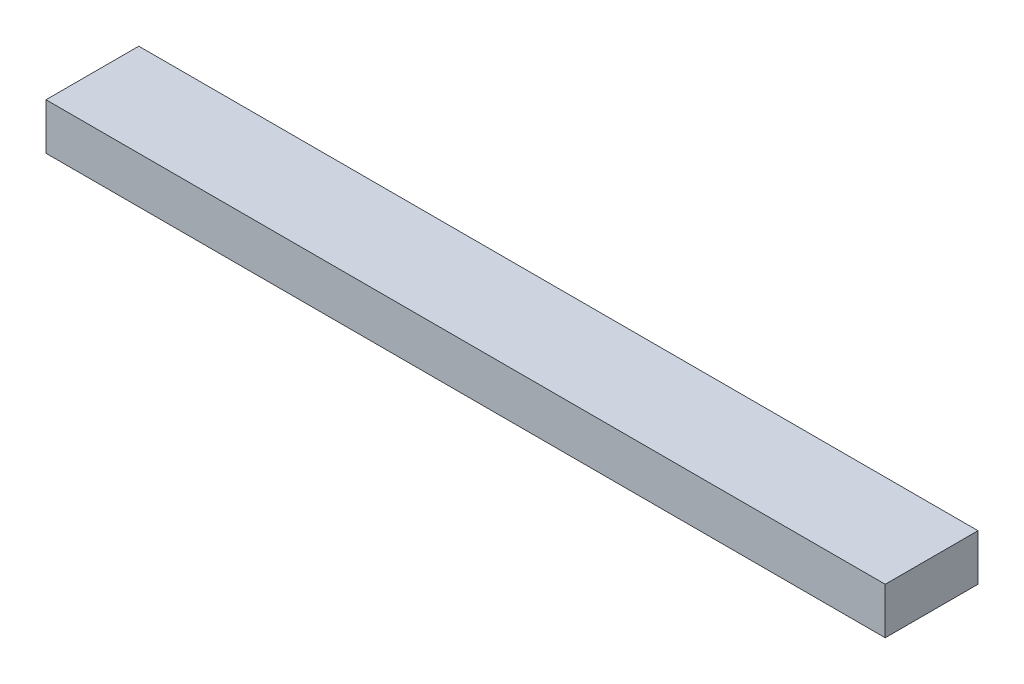
ISO-10303-21;
HEADER;
FILE_DESCRIPTION(('STEP AP214'),'2;1');
FILE_NAME('part.step','',(''),(''),'','','');
FILE_SCHEMA(('AUTOMOTIVE_DESIGN { 1 0 10303 214 1 1 1 1 }'));
ENDSEC;
DATA;
#1=APPLICATION_CONTEXT('core data for automotive mechanical design processes');
#2=APPLICATION_PROTOCOL_DEFINITION('international standard','automotive_design',2000,#1);
#3=PRODUCT_CONTEXT('',#1,'mechanical');
#4=PRODUCT('Part','Part','',(#3));
#5=PRODUCT_RELATED_PRODUCT_CATEGORY('part','',(#4));
#6=PRODUCT_DEFINITION_FORMATION('','',#4);
#7=PRODUCT_DEFINITION_CONTEXT('part definition',#1,'design');
#8=PRODUCT_DEFINITION('design','',#6,#7);
#9=PRODUCT_DEFINITION_SHAPE('','',#8);
#10=(LENGTH_UNIT() NAMED_UNIT(*) SI_UNIT(.MILLI.,.METRE.));
#11=(NAMED_UNIT(*) PLANE_ANGLE_UNIT() SI_UNIT($,.RADIAN.));
#12=(NAMED_UNIT(*) SI_UNIT($,.STERADIAN.) SOLID_ANGLE_UNIT());
#13=UNCERTAINTY_MEASURE_WITH_UNIT(LENGTH_MEASURE(1.E-05),#10,'distance_accuracy_value','');
#14=(GEOMETRIC_REPRESENTATION_CONTEXT(3) GLOBAL_UNCERTAINTY_ASSIGNED_CONTEXT((#13)) GLOBAL_UNIT_ASSIGNED_CONTEXT((#10,
#11,#12)) REPRESENTATION_CONTEXT('',''));
#15=CARTESIAN_POINT('',(0.,0.,0.));
#16=DIRECTION('',(0.,0.,1.));
#17=DIRECTION('',(1.,0.,0.));
#18=AXIS2_PLACEMENT_3D('',#15,#16,#17);
#19=CARTESIAN_POINT('',(-1809.,-50.,100.));
#20=DIRECTION('',(0.,0.,1.));
#21=DIRECTION('',(1.,0.,0.));
#22=AXIS2_PLACEMENT_3D('',#19,#20,#21);
#23=PLANE('',#22);
#24=DIRECTION('',(0.,-1.,0.));
#25=VECTOR('',#24,1.);
#26=CARTESIAN_POINT('',(0.,-50.,100.));
#27=LINE('',#26,#25);
#28=CARTESIAN_POINT('',(0.,50.,100.));
#29=VERTEX_POINT('',#28);
#30=CARTESIAN_POINT('',(0.,-50.,100.));
#31=VERTEX_POINT('',#30);
#32=EDGE_CURVE('E99',#29,#31,#27,.T.);
#33=ORIENTED_EDGE('',*,*,#32,.F.);
#34=DIRECTION('',(1.,0.,0.));
#35=VECTOR('',#34,1.);
#36=CARTESIAN_POINT('',(-1809.,50.,100.));
#37=LINE('',#36,#35);
#38=CARTESIAN_POINT('',(-1809.,50.,100.));
#39=VERTEX_POINT('',#38);
#40=EDGE_CURVE('E11',#39,#29,#37,.T.);
#41=ORIENTED_EDGE('',*,*,#40,.F.);
#42=DIRECTION('',(0.,-1.,0.));
#43=VECTOR('',#42,1.);
#44=CARTESIAN_POINT('',(-1809.,-50.,100.));
#45=LINE('',#44,#43);
#46=CARTESIAN_POINT('',(-1809.,-50.,100.));
#47=VERTEX_POINT('',#46);
#48=EDGE_CURVE('E93',#39,#47,#45,.T.);
#49=ORIENTED_EDGE('',*,*,#48,.T.);
#50=DIRECTION('',(1.,0.,0.));
#51=VECTOR('',#50,1.);
#52=CARTESIAN_POINT('',(-1809.,-50.,100.));
#53=LINE('',#52,#51);
#54=EDGE_CURVE('E38',#47,#31,#53,.T.);
#55=ORIENTED_EDGE('',*,*,#54,.T.);
#56=EDGE_LOOP('',(#33,#41,#49,#55));
#57=FACE_BOUND('',#56,.T.);
#58=ADVANCED_FACE('F35',(#57),#23,.T.);
#59=CARTESIAN_POINT('',(-1809.,50.,-100.));
#60=DIRECTION('',(0.,1.,0.));
#61=DIRECTION('',(0.,0.,1.));
#62=AXIS2_PLACEMENT_3D('',#59,#60,#61);
#63=PLANE('',#62);
#64=DIRECTION('',(0.,0.,1.));
#65=VECTOR('',#64,1.);
#66=CARTESIAN_POINT('',(0.,50.,-100.));
#67=LINE('',#66,#65);
#68=CARTESIAN_POINT('',(0.,50.,-100.));
#69=VERTEX_POINT('',#68);
#70=EDGE_CURVE('E95',#69,#29,#67,.T.);
#71=ORIENTED_EDGE('',*,*,#70,.F.);
#72=DIRECTION('',(1.,0.,0.));
#73=VECTOR('',#72,1.);
#74=CARTESIAN_POINT('',(-1809.,50.,-100.));
#75=LINE('',#74,#73);
#76=CARTESIAN_POINT('',(-1809.,50.,-100.));
#77=VERTEX_POINT('',#76);
#78=EDGE_CURVE('E44',#77,#69,#75,.T.);
#79=ORIENTED_EDGE('',*,*,#78,.F.);
#80=DIRECTION('',(0.,0.,1.));
#81=VECTOR('',#80,1.);
#82=CARTESIAN_POINT('',(-1809.,50.,-100.));
#83=LINE('',#82,#81);
#84=EDGE_CURVE('E90',#77,#39,#83,.T.);
#85=ORIENTED_EDGE('',*,*,#84,.T.);
#86=ORIENTED_EDGE('',*,*,#40,.T.);
#87=EDGE_LOOP('',(#71,#79,#85,#86));
#88=FACE_BOUND('',#87,.T.);
#89=ADVANCED_FACE('F109',(#88),#63,.T.);
#90=CARTESIAN_POINT('',(-1809.,-50.,-100.));
#91=DIRECTION('',(0.,0.,-1.));
#92=DIRECTION('',(-1.,0.,0.));
#93=AXIS2_PLACEMENT_3D('',#90,#91,#92);
#94=PLANE('',#93);
#95=DIRECTION('',(0.,1.,0.));
#96=VECTOR('',#95,1.);
#97=CARTESIAN_POINT('',(0.,-50.,-100.));
#98=LINE('',#97,#96);
#99=CARTESIAN_POINT('',(0.,-50.,-100.));
#100=VERTEX_POINT('',#99);
#101=EDGE_CURVE('E85',#100,#69,#98,.T.);
#102=ORIENTED_EDGE('',*,*,#101,.F.);
#103=DIRECTION('',(1.,0.,0.));
#104=VECTOR('',#103,1.);
#105=CARTESIAN_POINT('',(-1809.,-50.,-100.));
#106=LINE('',#105,#104);
#107=CARTESIAN_POINT('',(-1809.,-50.,-100.));
#108=VERTEX_POINT('',#107);
#109=EDGE_CURVE('E80',#108,#100,#106,.T.);
#110=ORIENTED_EDGE('',*,*,#109,.F.);
#111=DIRECTION('',(0.,1.,0.));
#112=VECTOR('',#111,1.);
#113=CARTESIAN_POINT('',(-1809.,-50.,-100.));
#114=LINE('',#113,#112);
#115=EDGE_CURVE('E83',#108,#77,#114,.T.);
#116=ORIENTED_EDGE('',*,*,#115,.T.);
#117=ORIENTED_EDGE('',*,*,#78,.T.);
#118=EDGE_LOOP('',(#102,#110,#116,#117));
#119=FACE_BOUND('',#118,.T.);
#120=ADVANCED_FACE('F82',(#119),#94,.T.);
#121=CARTESIAN_POINT('',(-1809.,-50.,-100.));
#122=DIRECTION('',(0.,-1.,0.));
#123=DIRECTION('',(0.,0.,-1.));
#124=AXIS2_PLACEMENT_3D('',#121,#122,#123);
#125=PLANE('',#124);
#126=DIRECTION('',(0.,0.,-1.));
#127=VECTOR('',#126,1.);
#128=CARTESIAN_POINT('',(0.,-50.,-100.));
#129=LINE('',#128,#127);
#130=EDGE_CURVE('E102',#31,#100,#129,.T.);
#131=ORIENTED_EDGE('',*,*,#130,.F.);
#132=ORIENTED_EDGE('',*,*,#54,.F.);
#133=DIRECTION('',(0.,0.,-1.));
#134=VECTOR('',#133,1.);
#135=CARTESIAN_POINT('',(-1809.,-50.,-100.));
#136=LINE('',#135,#134);
#137=EDGE_CURVE('E89',#47,#108,#136,.T.);
#138=ORIENTED_EDGE('',*,*,#137,.T.);
#139=ORIENTED_EDGE('',*,*,#109,.T.);
#140=EDGE_LOOP('',(#131,#132,#138,#139));
#141=FACE_BOUND('',#140,.T.);
#142=ADVANCED_FACE('F92',(#141),#125,.T.);
#143=CARTESIAN_POINT('',(-1809.,0.,0.));
#144=DIRECTION('',(1.,0.,0.));
#145=DIRECTION('',(0.,0.,-1.));
#146=AXIS2_PLACEMENT_3D('',#143,#144,#145);
#147=PLANE('',#146);
#148=ORIENTED_EDGE('',*,*,#48,.F.);
#149=ORIENTED_EDGE('',*,*,#84,.F.);
#150=ORIENTED_EDGE('',*,*,#115,.F.);
#151=ORIENTED_EDGE('',*,*,#137,.F.);
#152=EDGE_LOOP('',(#148,#149,#150,#151));
#153=FACE_BOUND('',#152,.T.);
#154=ADVANCED_FACE('F88',(#153),#147,.F.);
#155=CARTESIAN_POINT('',(0.,0.,0.));
#156=DIRECTION('',(1.,0.,0.));
#157=DIRECTION('',(0.,0.,-1.));
#158=AXIS2_PLACEMENT_3D('',#155,#156,#157);
#159=PLANE('',#158);
#160=ORIENTED_EDGE('',*,*,#32,.T.);
#161=ORIENTED_EDGE('',*,*,#130,.T.);
#162=ORIENTED_EDGE('',*,*,#101,.T.);
#163=ORIENTED_EDGE('',*,*,#70,.T.);
#164=EDGE_LOOP('',(#160,#161,#162,#163));
#165=FACE_BOUND('',#164,.T.);
#166=ADVANCED_FACE('F108',(#165),#159,.T.);
#167=CLOSED_SHELL('',(#58,#89,#120,#142,#154,#166));
#168=MANIFOLD_SOLID_BREP('B2',#167);
#169=ADVANCED_BREP_SHAPE_REPRESENTATION('',(#18,#168),#14);
#170=SHAPE_DEFINITION_REPRESENTATION(#9,#169);
ENDSEC;
END-ISO-10303-21;
